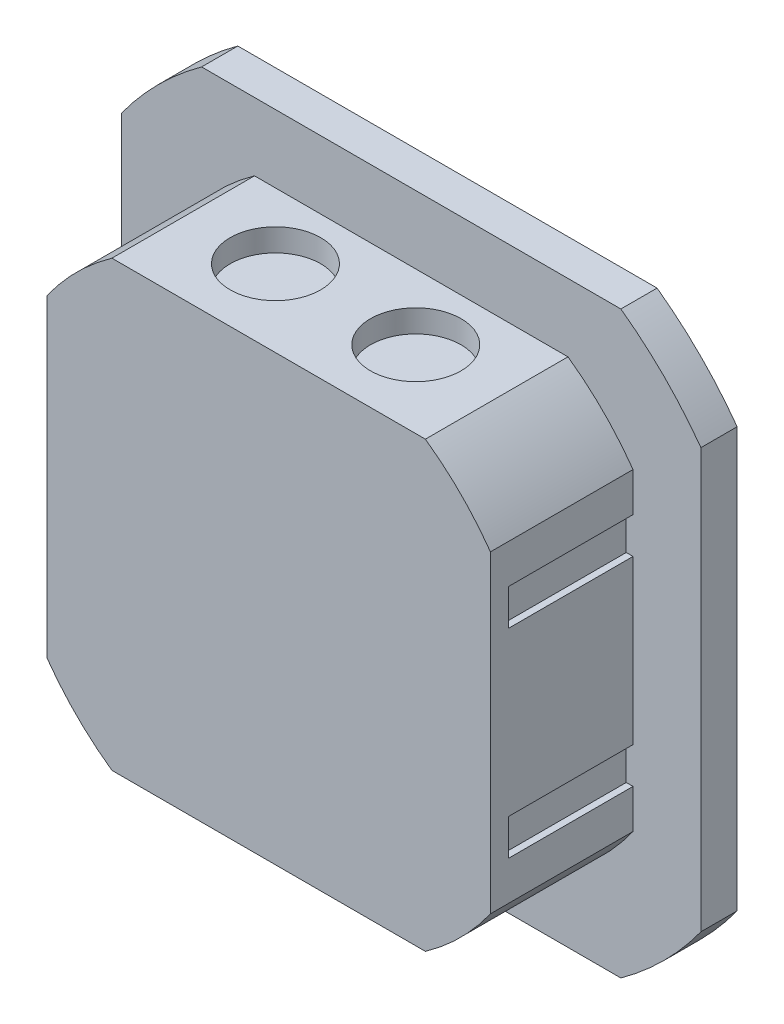
ISO-10303-21;
HEADER;
FILE_DESCRIPTION(('STEP AP214'),'2;1');
FILE_NAME('part.step','',(''),(''),'','','');
FILE_SCHEMA(('AUTOMOTIVE_DESIGN { 1 0 10303 214 1 1 1 1 }'));
ENDSEC;
DATA;
#1=APPLICATION_CONTEXT('core data for automotive mechanical design processes');
#2=APPLICATION_PROTOCOL_DEFINITION('international standard','automotive_design',2000,#1);
#3=PRODUCT_CONTEXT('',#1,'mechanical');
#4=PRODUCT('Part','Part','',(#3));
#5=PRODUCT_RELATED_PRODUCT_CATEGORY('part','',(#4));
#6=PRODUCT_DEFINITION_FORMATION('','',#4);
#7=PRODUCT_DEFINITION_CONTEXT('part definition',#1,'design');
#8=PRODUCT_DEFINITION('design','',#6,#7);
#9=PRODUCT_DEFINITION_SHAPE('','',#8);
#10=(LENGTH_UNIT() NAMED_UNIT(*) SI_UNIT(.MILLI.,.METRE.));
#11=(NAMED_UNIT(*) PLANE_ANGLE_UNIT() SI_UNIT($,.RADIAN.));
#12=(NAMED_UNIT(*) SI_UNIT($,.STERADIAN.) SOLID_ANGLE_UNIT());
#13=UNCERTAINTY_MEASURE_WITH_UNIT(LENGTH_MEASURE(1.E-05),#10,'distance_accuracy_value','');
#14=(GEOMETRIC_REPRESENTATION_CONTEXT(3) GLOBAL_UNCERTAINTY_ASSIGNED_CONTEXT((#13)) GLOBAL_UNIT_ASSIGNED_CONTEXT((#10,
#11,#12)) REPRESENTATION_CONTEXT('',''));
#15=CARTESIAN_POINT('',(0.,0.,0.));
#16=DIRECTION('',(0.,0.,1.));
#17=DIRECTION('',(1.,0.,0.));
#18=AXIS2_PLACEMENT_3D('',#15,#16,#17);
#19=CARTESIAN_POINT('',(-15.5,44.,14.5));
#20=DIRECTION('',(0.,1.,0.));
#21=DIRECTION('',(0.,0.,1.));
#22=AXIS2_PLACEMENT_3D('',#19,#20,#21);
#23=PLANE('',#22);
#24=CARTESIAN_POINT('',(-15.5,44.,14.5));
#25=DIRECTION('',(0.,-1.,0.));
#26=DIRECTION('',(0.,0.,-1.));
#27=AXIS2_PLACEMENT_3D('',#24,#25,#26);
#28=CIRCLE('',#27,10.);
#29=CARTESIAN_POINT('',(-15.5,44.,4.5));
#30=VERTEX_POINT('',#29);
#31=EDGE_CURVE('E20',#30,#30,#28,.F.);
#32=ORIENTED_EDGE('',*,*,#31,.T.);
#33=EDGE_LOOP('',(#32));
#34=FACE_BOUND('',#33,.T.);
#35=ADVANCED_FACE('F17',(#34),#23,.T.);
#36=CARTESIAN_POINT('',(15.5,44.,14.5));
#37=DIRECTION('',(0.,1.,0.));
#38=DIRECTION('',(0.,0.,1.));
#39=AXIS2_PLACEMENT_3D('',#36,#37,#38);
#40=PLANE('',#39);
#41=CARTESIAN_POINT('',(15.5,44.,14.5));
#42=DIRECTION('',(0.,-1.,0.));
#43=DIRECTION('',(0.,0.,-1.));
#44=AXIS2_PLACEMENT_3D('',#41,#42,#43);
#45=CIRCLE('',#44,10.);
#46=CARTESIAN_POINT('',(15.5,44.,4.5));
#47=VERTEX_POINT('',#46);
#48=EDGE_CURVE('E290',#47,#47,#45,.F.);
#49=ORIENTED_EDGE('',*,*,#48,.T.);
#50=EDGE_LOOP('',(#49));
#51=FACE_BOUND('',#50,.T.);
#52=ADVANCED_FACE('F751',(#51),#40,.T.);
#53=CARTESIAN_POINT('',(-49.,26.,0.));
#54=DIRECTION('',(0.,1.,0.));
#55=DIRECTION('',(0.,0.,1.));
#56=AXIS2_PLACEMENT_3D('',#53,#54,#55);
#57=PLANE('',#56);
#58=DIRECTION('',(0.,0.,1.));
#59=VECTOR('',#58,1.);
#60=CARTESIAN_POINT('',(-49.,26.,31.5));
#61=LINE('',#60,#59);
#62=CARTESIAN_POINT('',(-49.,26.,0.));
#63=VERTEX_POINT('',#62);
#64=CARTESIAN_POINT('',(-49.,26.,27.5));
#65=VERTEX_POINT('',#64);
#66=EDGE_CURVE('E356',#63,#65,#61,.T.);
#67=ORIENTED_EDGE('',*,*,#66,.F.);
#68=DIRECTION('',(1.,0.,0.));
#69=VECTOR('',#68,1.);
#70=CARTESIAN_POINT('',(-49.,26.,0.));
#71=LINE('',#70,#69);
#72=CARTESIAN_POINT('',(-47.5,26.,0.));
#73=VERTEX_POINT('',#72);
#74=EDGE_CURVE('E182',#73,#63,#71,.F.);
#75=ORIENTED_EDGE('',*,*,#74,.F.);
#76=DIRECTION('',(0.,0.,-1.));
#77=VECTOR('',#76,1.);
#78=CARTESIAN_POINT('',(-47.5,26.,0.));
#79=LINE('',#78,#77);
#80=CARTESIAN_POINT('',(-47.5,26.,27.5));
#81=VERTEX_POINT('',#80);
#82=EDGE_CURVE('E412',#73,#81,#79,.F.);
#83=ORIENTED_EDGE('',*,*,#82,.T.);
#84=DIRECTION('',(1.,0.,0.));
#85=VECTOR('',#84,1.);
#86=CARTESIAN_POINT('',(-48.25,26.,27.5));
#87=LINE('',#86,#85);
#88=EDGE_CURVE('E346',#81,#65,#87,.F.);
#89=ORIENTED_EDGE('',*,*,#88,.T.);
#90=EDGE_LOOP('',(#67,#75,#83,#89));
#91=FACE_BOUND('',#90,.T.);
#92=ADVANCED_FACE('F723',(#91),#57,.F.);
#93=CARTESIAN_POINT('',(-48.25,22.,27.5));
#94=DIRECTION('',(0.,0.,1.));
#95=DIRECTION('',(1.,0.,0.));
#96=AXIS2_PLACEMENT_3D('',#93,#94,#95);
#97=PLANE('',#96);
#98=DIRECTION('',(1.,0.,0.));
#99=VECTOR('',#98,1.);
#100=CARTESIAN_POINT('',(-47.5,18.,27.5));
#101=LINE('',#100,#99);
#102=CARTESIAN_POINT('',(-47.5,18.,27.5));
#103=VERTEX_POINT('',#102);
#104=CARTESIAN_POINT('',(-49.,18.,27.5));
#105=VERTEX_POINT('',#104);
#106=EDGE_CURVE('E334',#103,#105,#101,.F.);
#107=ORIENTED_EDGE('',*,*,#106,.T.);
#108=DIRECTION('',(0.,1.,0.));
#109=VECTOR('',#108,1.);
#110=CARTESIAN_POINT('',(-49.,49.,27.5));
#111=LINE('',#110,#109);
#112=EDGE_CURVE('E354',#65,#105,#111,.F.);
#113=ORIENTED_EDGE('',*,*,#112,.F.);
#114=ORIENTED_EDGE('',*,*,#88,.F.);
#115=DIRECTION('',(0.,1.,0.));
#116=VECTOR('',#115,1.);
#117=CARTESIAN_POINT('',(-47.5,26.,27.5));
#118=LINE('',#117,#116);
#119=EDGE_CURVE('E409',#81,#103,#118,.F.);
#120=ORIENTED_EDGE('',*,*,#119,.T.);
#121=EDGE_LOOP('',(#107,#113,#114,#120));
#122=FACE_BOUND('',#121,.T.);
#123=ADVANCED_FACE('F726',(#122),#97,.F.);
#124=CARTESIAN_POINT('',(-47.5,18.,0.));
#125=DIRECTION('',(0.,-1.,0.));
#126=DIRECTION('',(0.,0.,-1.));
#127=AXIS2_PLACEMENT_3D('',#124,#125,#126);
#128=PLANE('',#127);
#129=DIRECTION('',(0.,0.,-1.));
#130=VECTOR('',#129,1.);
#131=CARTESIAN_POINT('',(-47.5,18.,0.));
#132=LINE('',#131,#130);
#133=CARTESIAN_POINT('',(-47.5,18.,0.));
#134=VERTEX_POINT('',#133);
#135=EDGE_CURVE('E397',#103,#134,#132,.T.);
#136=ORIENTED_EDGE('',*,*,#135,.T.);
#137=DIRECTION('',(1.,0.,0.));
#138=VECTOR('',#137,1.);
#139=CARTESIAN_POINT('',(-47.5,18.,0.));
#140=LINE('',#139,#138);
#141=CARTESIAN_POINT('',(-49.,18.,0.));
#142=VERTEX_POINT('',#141);
#143=EDGE_CURVE('E190',#142,#134,#140,.T.);
#144=ORIENTED_EDGE('',*,*,#143,.F.);
#145=DIRECTION('',(0.,0.,1.));
#146=VECTOR('',#145,1.);
#147=CARTESIAN_POINT('',(-49.,18.,31.5));
#148=LINE('',#147,#146);
#149=EDGE_CURVE('E330',#105,#142,#148,.F.);
#150=ORIENTED_EDGE('',*,*,#149,.F.);
#151=ORIENTED_EDGE('',*,*,#106,.F.);
#152=EDGE_LOOP('',(#136,#144,#150,#151));
#153=FACE_BOUND('',#152,.T.);
#154=ADVANCED_FACE('F730',(#153),#128,.F.);
#155=CARTESIAN_POINT('',(-49.,-18.,0.));
#156=DIRECTION('',(0.,1.,0.));
#157=DIRECTION('',(0.,0.,1.));
#158=AXIS2_PLACEMENT_3D('',#155,#156,#157);
#159=PLANE('',#158);
#160=DIRECTION('',(0.,0.,1.));
#161=VECTOR('',#160,1.);
#162=CARTESIAN_POINT('',(-49.,-18.,31.5));
#163=LINE('',#162,#161);
#164=CARTESIAN_POINT('',(-49.,-18.,0.));
#165=VERTEX_POINT('',#164);
#166=CARTESIAN_POINT('',(-49.,-18.,27.5));
#167=VERTEX_POINT('',#166);
#168=EDGE_CURVE('E321',#165,#167,#163,.T.);
#169=ORIENTED_EDGE('',*,*,#168,.F.);
#170=DIRECTION('',(1.,0.,0.));
#171=VECTOR('',#170,1.);
#172=CARTESIAN_POINT('',(-49.,-18.,0.));
#173=LINE('',#172,#171);
#174=CARTESIAN_POINT('',(-47.5,-18.,0.));
#175=VERTEX_POINT('',#174);
#176=EDGE_CURVE('E326',#175,#165,#173,.F.);
#177=ORIENTED_EDGE('',*,*,#176,.F.);
#178=DIRECTION('',(0.,0.,-1.));
#179=VECTOR('',#178,1.);
#180=CARTESIAN_POINT('',(-47.5,-18.,0.));
#181=LINE('',#180,#179);
#182=CARTESIAN_POINT('',(-47.5,-18.,27.5));
#183=VERTEX_POINT('',#182);
#184=EDGE_CURVE('E390',#175,#183,#181,.F.);
#185=ORIENTED_EDGE('',*,*,#184,.T.);
#186=DIRECTION('',(1.,0.,0.));
#187=VECTOR('',#186,1.);
#188=CARTESIAN_POINT('',(-48.25,-18.,27.5));
#189=LINE('',#188,#187);
#190=EDGE_CURVE('E311',#183,#167,#189,.F.);
#191=ORIENTED_EDGE('',*,*,#190,.T.);
#192=EDGE_LOOP('',(#169,#177,#185,#191));
#193=FACE_BOUND('',#192,.T.);
#194=ADVANCED_FACE('F736',(#193),#159,.F.);
#195=CARTESIAN_POINT('',(-48.25,-22.,27.5));
#196=DIRECTION('',(0.,0.,1.));
#197=DIRECTION('',(1.,0.,0.));
#198=AXIS2_PLACEMENT_3D('',#195,#196,#197);
#199=PLANE('',#198);
#200=ORIENTED_EDGE('',*,*,#190,.F.);
#201=DIRECTION('',(0.,1.,0.));
#202=VECTOR('',#201,1.);
#203=CARTESIAN_POINT('',(-47.5,-18.,27.5));
#204=LINE('',#203,#202);
#205=CARTESIAN_POINT('',(-47.5,-26.,27.5));
#206=VERTEX_POINT('',#205);
#207=EDGE_CURVE('E394',#183,#206,#204,.F.);
#208=ORIENTED_EDGE('',*,*,#207,.T.);
#209=DIRECTION('',(1.,0.,0.));
#210=VECTOR('',#209,1.);
#211=CARTESIAN_POINT('',(-47.5,-26.,27.5));
#212=LINE('',#211,#210);
#213=CARTESIAN_POINT('',(-49.,-26.,27.5));
#214=VERTEX_POINT('',#213);
#215=EDGE_CURVE('E144',#206,#214,#212,.F.);
#216=ORIENTED_EDGE('',*,*,#215,.T.);
#217=DIRECTION('',(0.,1.,0.));
#218=VECTOR('',#217,1.);
#219=CARTESIAN_POINT('',(-49.,49.,27.5));
#220=LINE('',#219,#218);
#221=EDGE_CURVE('E317',#167,#214,#220,.F.);
#222=ORIENTED_EDGE('',*,*,#221,.F.);
#223=EDGE_LOOP('',(#200,#208,#216,#222));
#224=FACE_BOUND('',#223,.T.);
#225=ADVANCED_FACE('F498',(#224),#199,.F.);
#226=CARTESIAN_POINT('',(-47.5,-26.,0.));
#227=DIRECTION('',(0.,-1.,0.));
#228=DIRECTION('',(0.,0.,-1.));
#229=AXIS2_PLACEMENT_3D('',#226,#227,#228);
#230=PLANE('',#229);
#231=DIRECTION('',(0.,0.,-1.));
#232=VECTOR('',#231,1.);
#233=CARTESIAN_POINT('',(-47.5,-26.,0.));
#234=LINE('',#233,#232);
#235=CARTESIAN_POINT('',(-47.5,-26.,0.));
#236=VERTEX_POINT('',#235);
#237=EDGE_CURVE('E388',#206,#236,#234,.T.);
#238=ORIENTED_EDGE('',*,*,#237,.T.);
#239=DIRECTION('',(1.,0.,0.));
#240=VECTOR('',#239,1.);
#241=CARTESIAN_POINT('',(-47.5,-26.,0.));
#242=LINE('',#241,#240);
#243=CARTESIAN_POINT('',(-49.,-26.,0.));
#244=VERTEX_POINT('',#243);
#245=EDGE_CURVE('E309',#244,#236,#242,.T.);
#246=ORIENTED_EDGE('',*,*,#245,.F.);
#247=DIRECTION('',(0.,0.,1.));
#248=VECTOR('',#247,1.);
#249=CARTESIAN_POINT('',(-49.,-26.,31.5));
#250=LINE('',#249,#248);
#251=EDGE_CURVE('E320',#214,#244,#250,.F.);
#252=ORIENTED_EDGE('',*,*,#251,.F.);
#253=ORIENTED_EDGE('',*,*,#215,.F.);
#254=EDGE_LOOP('',(#238,#246,#252,#253));
#255=FACE_BOUND('',#254,.T.);
#256=ADVANCED_FACE('F487',(#255),#230,.F.);
#257=CARTESIAN_POINT('',(-15.5,49.,14.5));
#258=DIRECTION('',(0.,-1.,0.));
#259=DIRECTION('',(0.,0.,-1.));
#260=AXIS2_PLACEMENT_3D('',#257,#258,#259);
#261=CYLINDRICAL_SURFACE('',#260,10.);
#262=CARTESIAN_POINT('',(-15.5,49.,14.5));
#263=DIRECTION('',(0.,-1.,0.));
#264=DIRECTION('',(0.,0.,-1.));
#265=AXIS2_PLACEMENT_3D('',#262,#263,#264);
#266=CIRCLE('',#265,10.);
#267=CARTESIAN_POINT('',(-15.5,49.,4.5));
#268=VERTEX_POINT('',#267);
#269=EDGE_CURVE('E303',#268,#268,#266,.T.);
#270=ORIENTED_EDGE('',*,*,#269,.F.);
#271=EDGE_LOOP('',(#270));
#272=FACE_BOUND('',#271,.T.);
#273=ORIENTED_EDGE('',*,*,#31,.F.);
#274=EDGE_LOOP('',(#273));
#275=FACE_BOUND('',#274,.T.);
#276=ADVANCED_FACE('F484',(#272,#275),#261,.F.);
#277=CARTESIAN_POINT('',(15.5,49.,14.5));
#278=DIRECTION('',(0.,-1.,0.));
#279=DIRECTION('',(0.,0.,-1.));
#280=AXIS2_PLACEMENT_3D('',#277,#278,#279);
#281=CYLINDRICAL_SURFACE('',#280,10.);
#282=CARTESIAN_POINT('',(15.5,49.,14.5));
#283=DIRECTION('',(0.,-1.,0.));
#284=DIRECTION('',(0.,0.,-1.));
#285=AXIS2_PLACEMENT_3D('',#282,#283,#284);
#286=CIRCLE('',#285,10.);
#287=CARTESIAN_POINT('',(15.5,49.,4.5));
#288=VERTEX_POINT('',#287);
#289=EDGE_CURVE('E468',#288,#288,#286,.T.);
#290=ORIENTED_EDGE('',*,*,#289,.F.);
#291=EDGE_LOOP('',(#290));
#292=FACE_BOUND('',#291,.T.);
#293=ORIENTED_EDGE('',*,*,#48,.F.);
#294=EDGE_LOOP('',(#293));
#295=FACE_BOUND('',#294,.T.);
#296=ADVANCED_FACE('F486',(#292,#295),#281,.F.);
#297=CARTESIAN_POINT('',(49.,-26.,0.));
#298=DIRECTION('',(0.,-1.,0.));
#299=DIRECTION('',(0.,0.,-1.));
#300=AXIS2_PLACEMENT_3D('',#297,#298,#299);
#301=PLANE('',#300);
#302=DIRECTION('',(0.,0.,-1.));
#303=VECTOR('',#302,1.);
#304=CARTESIAN_POINT('',(49.,-26.,31.5));
#305=LINE('',#304,#303);
#306=CARTESIAN_POINT('',(49.,-26.,0.));
#307=VERTEX_POINT('',#306);
#308=CARTESIAN_POINT('',(49.,-26.,27.5));
#309=VERTEX_POINT('',#308);
#310=EDGE_CURVE('E298',#307,#309,#305,.F.);
#311=ORIENTED_EDGE('',*,*,#310,.F.);
#312=DIRECTION('',(1.,0.,0.));
#313=VECTOR('',#312,1.);
#314=CARTESIAN_POINT('',(49.,-26.,0.));
#315=LINE('',#314,#313);
#316=CARTESIAN_POINT('',(47.5,-26.,0.));
#317=VERTEX_POINT('',#316);
#318=EDGE_CURVE('E241',#317,#307,#315,.T.);
#319=ORIENTED_EDGE('',*,*,#318,.F.);
#320=DIRECTION('',(0.,0.,1.));
#321=VECTOR('',#320,1.);
#322=CARTESIAN_POINT('',(47.5,-26.,0.));
#323=LINE('',#322,#321);
#324=CARTESIAN_POINT('',(47.5,-26.,27.5));
#325=VERTEX_POINT('',#324);
#326=EDGE_CURVE('E380',#317,#325,#323,.T.);
#327=ORIENTED_EDGE('',*,*,#326,.T.);
#328=DIRECTION('',(1.,0.,0.));
#329=VECTOR('',#328,1.);
#330=CARTESIAN_POINT('',(48.25,-26.,27.5));
#331=LINE('',#330,#329);
#332=EDGE_CURVE('E258',#325,#309,#331,.T.);
#333=ORIENTED_EDGE('',*,*,#332,.T.);
#334=EDGE_LOOP('',(#311,#319,#327,#333));
#335=FACE_BOUND('',#334,.T.);
#336=ADVANCED_FACE('F495',(#335),#301,.F.);
#337=CARTESIAN_POINT('',(48.25,-22.,27.5));
#338=DIRECTION('',(0.,0.,1.));
#339=DIRECTION('',(1.,0.,0.));
#340=AXIS2_PLACEMENT_3D('',#337,#338,#339);
#341=PLANE('',#340);
#342=DIRECTION('',(0.,1.,0.));
#343=VECTOR('',#342,1.);
#344=CARTESIAN_POINT('',(49.,-49.,27.5));
#345=LINE('',#344,#343);
#346=CARTESIAN_POINT('',(49.,-18.,27.5));
#347=VERTEX_POINT('',#346);
#348=EDGE_CURVE('E266',#309,#347,#345,.T.);
#349=ORIENTED_EDGE('',*,*,#348,.F.);
#350=ORIENTED_EDGE('',*,*,#332,.F.);
#351=DIRECTION('',(0.,1.,0.));
#352=VECTOR('',#351,1.);
#353=CARTESIAN_POINT('',(47.5,-26.,27.5));
#354=LINE('',#353,#352);
#355=CARTESIAN_POINT('',(47.5,-18.,27.5));
#356=VERTEX_POINT('',#355);
#357=EDGE_CURVE('E377',#325,#356,#354,.T.);
#358=ORIENTED_EDGE('',*,*,#357,.T.);
#359=DIRECTION('',(1.,0.,0.));
#360=VECTOR('',#359,1.);
#361=CARTESIAN_POINT('',(47.5,-18.,27.5));
#362=LINE('',#361,#360);
#363=EDGE_CURVE('E257',#356,#347,#362,.T.);
#364=ORIENTED_EDGE('',*,*,#363,.T.);
#365=EDGE_LOOP('',(#349,#350,#358,#364));
#366=FACE_BOUND('',#365,.T.);
#367=ADVANCED_FACE('F605',(#366),#341,.F.);
#368=CARTESIAN_POINT('',(47.5,-18.,0.));
#369=DIRECTION('',(0.,1.,0.));
#370=DIRECTION('',(0.,0.,1.));
#371=AXIS2_PLACEMENT_3D('',#368,#369,#370);
#372=PLANE('',#371);
#373=DIRECTION('',(0.,0.,1.));
#374=VECTOR('',#373,1.);
#375=CARTESIAN_POINT('',(47.5,-18.,0.));
#376=LINE('',#375,#374);
#377=CARTESIAN_POINT('',(47.5,-18.,0.));
#378=VERTEX_POINT('',#377);
#379=EDGE_CURVE('E255',#356,#378,#376,.F.);
#380=ORIENTED_EDGE('',*,*,#379,.T.);
#381=DIRECTION('',(1.,0.,0.));
#382=VECTOR('',#381,1.);
#383=CARTESIAN_POINT('',(47.5,-18.,0.));
#384=LINE('',#383,#382);
#385=CARTESIAN_POINT('',(49.,-18.,0.));
#386=VERTEX_POINT('',#385);
#387=EDGE_CURVE('E247',#386,#378,#384,.F.);
#388=ORIENTED_EDGE('',*,*,#387,.F.);
#389=DIRECTION('',(0.,0.,-1.));
#390=VECTOR('',#389,1.);
#391=CARTESIAN_POINT('',(49.,-18.,31.5));
#392=LINE('',#391,#390);
#393=EDGE_CURVE('E253',#347,#386,#392,.T.);
#394=ORIENTED_EDGE('',*,*,#393,.F.);
#395=ORIENTED_EDGE('',*,*,#363,.F.);
#396=EDGE_LOOP('',(#380,#388,#394,#395));
#397=FACE_BOUND('',#396,.T.);
#398=ADVANCED_FACE('F252',(#397),#372,.F.);
#399=CARTESIAN_POINT('',(49.,18.,0.));
#400=DIRECTION('',(0.,-1.,0.));
#401=DIRECTION('',(0.,0.,-1.));
#402=AXIS2_PLACEMENT_3D('',#399,#400,#401);
#403=PLANE('',#402);
#404=DIRECTION('',(0.,0.,-1.));
#405=VECTOR('',#404,1.);
#406=CARTESIAN_POINT('',(49.,18.,31.5));
#407=LINE('',#406,#405);
#408=CARTESIAN_POINT('',(49.,18.,0.));
#409=VERTEX_POINT('',#408);
#410=CARTESIAN_POINT('',(49.,18.,27.5));
#411=VERTEX_POINT('',#410);
#412=EDGE_CURVE('E268',#409,#411,#407,.F.);
#413=ORIENTED_EDGE('',*,*,#412,.F.);
#414=DIRECTION('',(1.,0.,0.));
#415=VECTOR('',#414,1.);
#416=CARTESIAN_POINT('',(49.,18.,0.));
#417=LINE('',#416,#415);
#418=CARTESIAN_POINT('',(47.5,18.,0.));
#419=VERTEX_POINT('',#418);
#420=EDGE_CURVE('E273',#419,#409,#417,.T.);
#421=ORIENTED_EDGE('',*,*,#420,.F.);
#422=DIRECTION('',(0.,0.,1.));
#423=VECTOR('',#422,1.);
#424=CARTESIAN_POINT('',(47.5,18.,0.));
#425=LINE('',#424,#423);
#426=CARTESIAN_POINT('',(47.5,18.,27.5));
#427=VERTEX_POINT('',#426);
#428=EDGE_CURVE('E362',#419,#427,#425,.T.);
#429=ORIENTED_EDGE('',*,*,#428,.T.);
#430=DIRECTION('',(1.,0.,0.));
#431=VECTOR('',#430,1.);
#432=CARTESIAN_POINT('',(48.25,18.,27.5));
#433=LINE('',#432,#431);
#434=EDGE_CURVE('E680',#427,#411,#433,.T.);
#435=ORIENTED_EDGE('',*,*,#434,.T.);
#436=EDGE_LOOP('',(#413,#421,#429,#435));
#437=FACE_BOUND('',#436,.T.);
#438=ADVANCED_FACE('F598',(#437),#403,.F.);
#439=CARTESIAN_POINT('',(48.25,22.,27.5));
#440=DIRECTION('',(0.,0.,1.));
#441=DIRECTION('',(1.,0.,0.));
#442=AXIS2_PLACEMENT_3D('',#439,#440,#441);
#443=PLANE('',#442);
#444=ORIENTED_EDGE('',*,*,#434,.F.);
#445=DIRECTION('',(0.,1.,0.));
#446=VECTOR('',#445,1.);
#447=CARTESIAN_POINT('',(47.5,18.,27.5));
#448=LINE('',#447,#446);
#449=CARTESIAN_POINT('',(47.5,26.,27.5));
#450=VERTEX_POINT('',#449);
#451=EDGE_CURVE('E366',#427,#450,#448,.T.);
#452=ORIENTED_EDGE('',*,*,#451,.T.);
#453=DIRECTION('',(1.,0.,0.));
#454=VECTOR('',#453,1.);
#455=CARTESIAN_POINT('',(47.5,26.,27.5));
#456=LINE('',#455,#454);
#457=CARTESIAN_POINT('',(49.,26.,27.5));
#458=VERTEX_POINT('',#457);
#459=EDGE_CURVE('E676',#450,#458,#456,.T.);
#460=ORIENTED_EDGE('',*,*,#459,.T.);
#461=DIRECTION('',(0.,1.,0.));
#462=VECTOR('',#461,1.);
#463=CARTESIAN_POINT('',(49.,-49.,27.5));
#464=LINE('',#463,#462);
#465=EDGE_CURVE('E653',#411,#458,#464,.T.);
#466=ORIENTED_EDGE('',*,*,#465,.F.);
#467=EDGE_LOOP('',(#444,#452,#460,#466));
#468=FACE_BOUND('',#467,.T.);
#469=ADVANCED_FACE('F594',(#468),#443,.F.);
#470=CARTESIAN_POINT('',(47.5,26.,0.));
#471=DIRECTION('',(0.,1.,0.));
#472=DIRECTION('',(0.,0.,1.));
#473=AXIS2_PLACEMENT_3D('',#470,#471,#472);
#474=PLANE('',#473);
#475=DIRECTION('',(0.,0.,1.));
#476=VECTOR('',#475,1.);
#477=CARTESIAN_POINT('',(47.5,26.,0.));
#478=LINE('',#477,#476);
#479=CARTESIAN_POINT('',(47.5,26.,0.));
#480=VERTEX_POINT('',#479);
#481=EDGE_CURVE('E359',#450,#480,#478,.F.);
#482=ORIENTED_EDGE('',*,*,#481,.T.);
#483=DIRECTION('',(1.,0.,0.));
#484=VECTOR('',#483,1.);
#485=CARTESIAN_POINT('',(47.5,26.,0.));
#486=LINE('',#485,#484);
#487=CARTESIAN_POINT('',(49.,26.,0.));
#488=VERTEX_POINT('',#487);
#489=EDGE_CURVE('E678',#488,#480,#486,.F.);
#490=ORIENTED_EDGE('',*,*,#489,.F.);
#491=DIRECTION('',(0.,0.,-1.));
#492=VECTOR('',#491,1.);
#493=CARTESIAN_POINT('',(49.,26.,31.5));
#494=LINE('',#493,#492);
#495=EDGE_CURVE('E650',#458,#488,#494,.T.);
#496=ORIENTED_EDGE('',*,*,#495,.F.);
#497=ORIENTED_EDGE('',*,*,#459,.F.);
#498=EDGE_LOOP('',(#482,#490,#496,#497));
#499=FACE_BOUND('',#498,.T.);
#500=ADVANCED_FACE('F590',(#499),#474,.F.);
#501=CARTESIAN_POINT('',(0.,0.,31.5));
#502=DIRECTION('',(0.,0.,-1.));
#503=DIRECTION('',(-1.,0.,0.));
#504=AXIS2_PLACEMENT_3D('',#501,#502,#503);
#505=PLANE('',#504);
#506=CARTESIAN_POINT('',(0.,0.,31.5));
#507=DIRECTION('',(0.,0.,1.));
#508=DIRECTION('',(1.,0.,0.));
#509=AXIS2_PLACEMENT_3D('',#506,#507,#508);
#510=CIRCLE('',#509,60.);
#511=CARTESIAN_POINT('',(-34.6265793863616,-49.,31.5));
#512=VERTEX_POINT('',#511);
#513=CARTESIAN_POINT('',(-49.,-34.6265793863616,31.5));
#514=VERTEX_POINT('',#513);
#515=EDGE_CURVE('E391',#512,#514,#510,.F.);
#516=ORIENTED_EDGE('',*,*,#515,.F.);
#517=DIRECTION('',(1.,0.,0.));
#518=VECTOR('',#517,1.);
#519=CARTESIAN_POINT('',(-49.,-49.,31.5));
#520=LINE('',#519,#518);
#521=CARTESIAN_POINT('',(34.6265793863616,-49.,31.5));
#522=VERTEX_POINT('',#521);
#523=EDGE_CURVE('E135',#522,#512,#520,.F.);
#524=ORIENTED_EDGE('',*,*,#523,.F.);
#525=CARTESIAN_POINT('',(0.,0.,31.5));
#526=DIRECTION('',(0.,0.,1.));
#527=DIRECTION('',(1.,0.,0.));
#528=AXIS2_PLACEMENT_3D('',#525,#526,#527);
#529=CIRCLE('',#528,60.);
#530=CARTESIAN_POINT('',(49.,-34.6265793863616,31.5));
#531=VERTEX_POINT('',#530);
#532=EDGE_CURVE('E462',#531,#522,#529,.F.);
#533=ORIENTED_EDGE('',*,*,#532,.F.);
#534=DIRECTION('',(0.,1.,0.));
#535=VECTOR('',#534,1.);
#536=CARTESIAN_POINT('',(49.,-49.,31.5));
#537=LINE('',#536,#535);
#538=CARTESIAN_POINT('',(49.,34.6265793863616,31.5));
#539=VERTEX_POINT('',#538);
#540=EDGE_CURVE('E642',#539,#531,#537,.F.);
#541=ORIENTED_EDGE('',*,*,#540,.F.);
#542=CARTESIAN_POINT('',(0.,0.,31.5));
#543=DIRECTION('',(0.,0.,1.));
#544=DIRECTION('',(1.,0.,0.));
#545=AXIS2_PLACEMENT_3D('',#542,#543,#544);
#546=CIRCLE('',#545,60.);
#547=CARTESIAN_POINT('',(34.6265793863616,49.,31.5));
#548=VERTEX_POINT('',#547);
#549=EDGE_CURVE('E363',#548,#539,#546,.F.);
#550=ORIENTED_EDGE('',*,*,#549,.F.);
#551=DIRECTION('',(1.,0.,0.));
#552=VECTOR('',#551,1.);
#553=CARTESIAN_POINT('',(49.,49.,31.5));
#554=LINE('',#553,#552);
#555=CARTESIAN_POINT('',(-34.6265793863616,49.,31.5));
#556=VERTEX_POINT('',#555);
#557=EDGE_CURVE('E301',#556,#548,#554,.T.);
#558=ORIENTED_EDGE('',*,*,#557,.F.);
#559=CARTESIAN_POINT('',(0.,0.,31.5));
#560=DIRECTION('',(0.,0.,1.));
#561=DIRECTION('',(1.,0.,0.));
#562=AXIS2_PLACEMENT_3D('',#559,#560,#561);
#563=CIRCLE('',#562,60.);
#564=CARTESIAN_POINT('',(-49.,34.6265793863615,31.5));
#565=VERTEX_POINT('',#564);
#566=EDGE_CURVE('E473',#565,#556,#563,.F.);
#567=ORIENTED_EDGE('',*,*,#566,.F.);
#568=DIRECTION('',(0.,1.,0.));
#569=VECTOR('',#568,1.);
#570=CARTESIAN_POINT('',(-49.,49.,31.5));
#571=LINE('',#570,#569);
#572=EDGE_CURVE('E305',#514,#565,#571,.T.);
#573=ORIENTED_EDGE('',*,*,#572,.F.);
#574=EDGE_LOOP('',(#516,#524,#533,#541,#550,#558,#567,#573));
#575=FACE_BOUND('',#574,.T.);
#576=ADVANCED_FACE('F587',(#575),#505,.F.);
#577=CARTESIAN_POINT('',(-49.,-49.,31.5));
#578=DIRECTION('',(0.,-1.,0.));
#579=DIRECTION('',(0.,0.,-1.));
#580=AXIS2_PLACEMENT_3D('',#577,#578,#579);
#581=PLANE('',#580);
#582=DIRECTION('',(0.,0.,1.));
#583=VECTOR('',#582,1.);
#584=CARTESIAN_POINT('',(-34.6265793863616,-49.,0.));
#585=LINE('',#584,#583);
#586=CARTESIAN_POINT('',(-34.6265793863616,-49.,0.));
#587=VERTEX_POINT('',#586);
#588=EDGE_CURVE('E476',#587,#512,#585,.T.);
#589=ORIENTED_EDGE('',*,*,#588,.F.);
#590=DIRECTION('',(1.,0.,0.));
#591=VECTOR('',#590,1.);
#592=CARTESIAN_POINT('',(0.,-49.,0.));
#593=LINE('',#592,#591);
#594=CARTESIAN_POINT('',(34.6265793863616,-49.,0.));
#595=VERTEX_POINT('',#594);
#596=EDGE_CURVE('E461',#595,#587,#593,.F.);
#597=ORIENTED_EDGE('',*,*,#596,.F.);
#598=DIRECTION('',(0.,0.,1.));
#599=VECTOR('',#598,1.);
#600=CARTESIAN_POINT('',(34.6265793863616,-49.,0.));
#601=LINE('',#600,#599);
#602=EDGE_CURVE('E464',#522,#595,#601,.F.);
#603=ORIENTED_EDGE('',*,*,#602,.F.);
#604=ORIENTED_EDGE('',*,*,#523,.T.);
#605=EDGE_LOOP('',(#589,#597,#603,#604));
#606=FACE_BOUND('',#605,.T.);
#607=ADVANCED_FACE('F583',(#606),#581,.T.);
#608=CARTESIAN_POINT('',(0.,0.,0.));
#609=DIRECTION('',(0.,0.,1.));
#610=DIRECTION('',(1.,0.,0.));
#611=AXIS2_PLACEMENT_3D('',#608,#609,#610);
#612=CYLINDRICAL_SURFACE('',#611,60.);
#613=ORIENTED_EDGE('',*,*,#588,.T.);
#614=ORIENTED_EDGE('',*,*,#515,.T.);
#615=DIRECTION('',(0.,0.,1.));
#616=VECTOR('',#615,1.);
#617=CARTESIAN_POINT('',(-49.,-34.6265793863616,31.5));
#618=LINE('',#617,#616);
#619=CARTESIAN_POINT('',(-49.,-34.6265793863616,0.));
#620=VERTEX_POINT('',#619);
#621=EDGE_CURVE('E308',#620,#514,#618,.T.);
#622=ORIENTED_EDGE('',*,*,#621,.F.);
#623=CARTESIAN_POINT('',(0.,0.,0.));
#624=DIRECTION('',(0.,0.,1.));
#625=DIRECTION('',(1.,0.,0.));
#626=AXIS2_PLACEMENT_3D('',#623,#624,#625);
#627=CIRCLE('',#626,60.);
#628=EDGE_CURVE('E459',#587,#620,#627,.F.);
#629=ORIENTED_EDGE('',*,*,#628,.F.);
#630=EDGE_LOOP('',(#613,#614,#622,#629));
#631=FACE_BOUND('',#630,.T.);
#632=ADVANCED_FACE('F579',(#631),#612,.T.);
#633=CARTESIAN_POINT('',(-47.5,-18.,0.));
#634=DIRECTION('',(1.,0.,0.));
#635=DIRECTION('',(0.,0.,-1.));
#636=AXIS2_PLACEMENT_3D('',#633,#634,#635);
#637=PLANE('',#636);
#638=ORIENTED_EDGE('',*,*,#184,.F.);
#639=DIRECTION('',(0.,1.,0.));
#640=VECTOR('',#639,1.);
#641=CARTESIAN_POINT('',(-47.5,0.,0.));
#642=LINE('',#641,#640);
#643=EDGE_CURVE('E340',#236,#175,#642,.T.);
#644=ORIENTED_EDGE('',*,*,#643,.F.);
#645=ORIENTED_EDGE('',*,*,#237,.F.);
#646=ORIENTED_EDGE('',*,*,#207,.F.);
#647=EDGE_LOOP('',(#638,#644,#645,#646));
#648=FACE_BOUND('',#647,.T.);
#649=ADVANCED_FACE('F575',(#648),#637,.F.);
#650=CARTESIAN_POINT('',(-47.5,26.,0.));
#651=DIRECTION('',(1.,0.,0.));
#652=DIRECTION('',(0.,0.,-1.));
#653=AXIS2_PLACEMENT_3D('',#650,#651,#652);
#654=PLANE('',#653);
#655=ORIENTED_EDGE('',*,*,#82,.F.);
#656=DIRECTION('',(0.,1.,0.));
#657=VECTOR('',#656,1.);
#658=CARTESIAN_POINT('',(-47.5,0.,0.));
#659=LINE('',#658,#657);
#660=EDGE_CURVE('E339',#134,#73,#659,.T.);
#661=ORIENTED_EDGE('',*,*,#660,.F.);
#662=ORIENTED_EDGE('',*,*,#135,.F.);
#663=ORIENTED_EDGE('',*,*,#119,.F.);
#664=EDGE_LOOP('',(#655,#661,#662,#663));
#665=FACE_BOUND('',#664,.T.);
#666=ADVANCED_FACE('F571',(#665),#654,.F.);
#667=CARTESIAN_POINT('',(-49.,49.,31.5));
#668=DIRECTION('',(-1.,0.,0.));
#669=DIRECTION('',(0.,0.,1.));
#670=AXIS2_PLACEMENT_3D('',#667,#668,#669);
#671=PLANE('',#670);
#672=DIRECTION('',(0.,0.,1.));
#673=VECTOR('',#672,1.);
#674=CARTESIAN_POINT('',(-49.,34.6265793863615,0.));
#675=LINE('',#674,#673);
#676=CARTESIAN_POINT('',(-49.,34.6265793863615,0.));
#677=VERTEX_POINT('',#676);
#678=EDGE_CURVE('E307',#677,#565,#675,.T.);
#679=ORIENTED_EDGE('',*,*,#678,.F.);
#680=DIRECTION('',(0.,1.,0.));
#681=VECTOR('',#680,1.);
#682=CARTESIAN_POINT('',(-49.,0.,0.));
#683=LINE('',#682,#681);
#684=EDGE_CURVE('E419',#63,#677,#683,.T.);
#685=ORIENTED_EDGE('',*,*,#684,.F.);
#686=ORIENTED_EDGE('',*,*,#66,.T.);
#687=ORIENTED_EDGE('',*,*,#112,.T.);
#688=ORIENTED_EDGE('',*,*,#149,.T.);
#689=DIRECTION('',(0.,1.,0.));
#690=VECTOR('',#689,1.);
#691=CARTESIAN_POINT('',(-49.,0.,0.));
#692=LINE('',#691,#690);
#693=EDGE_CURVE('E337',#165,#142,#692,.T.);
#694=ORIENTED_EDGE('',*,*,#693,.F.);
#695=ORIENTED_EDGE('',*,*,#168,.T.);
#696=ORIENTED_EDGE('',*,*,#221,.T.);
#697=ORIENTED_EDGE('',*,*,#251,.T.);
#698=DIRECTION('',(0.,1.,0.));
#699=VECTOR('',#698,1.);
#700=CARTESIAN_POINT('',(-49.,0.,0.));
#701=LINE('',#700,#699);
#702=EDGE_CURVE('E402',#620,#244,#701,.T.);
#703=ORIENTED_EDGE('',*,*,#702,.F.);
#704=ORIENTED_EDGE('',*,*,#621,.T.);
#705=ORIENTED_EDGE('',*,*,#572,.T.);
#706=EDGE_LOOP('',(#679,#685,#686,#687,#688,#694,#695,#696,#697,#703,#704,#705));
#707=FACE_BOUND('',#706,.T.);
#708=ADVANCED_FACE('F567',(#707),#671,.T.);
#709=CARTESIAN_POINT('',(0.,0.,0.));
#710=DIRECTION('',(0.,0.,1.));
#711=DIRECTION('',(1.,0.,0.));
#712=AXIS2_PLACEMENT_3D('',#709,#710,#711);
#713=CYLINDRICAL_SURFACE('',#712,60.);
#714=DIRECTION('',(0.,0.,1.));
#715=VECTOR('',#714,1.);
#716=CARTESIAN_POINT('',(-34.6265793863616,49.,31.5));
#717=LINE('',#716,#715);
#718=CARTESIAN_POINT('',(-34.6265793863616,49.,0.));
#719=VERTEX_POINT('',#718);
#720=EDGE_CURVE('E304',#719,#556,#717,.T.);
#721=ORIENTED_EDGE('',*,*,#720,.F.);
#722=CARTESIAN_POINT('',(0.,0.,0.));
#723=DIRECTION('',(0.,0.,1.));
#724=DIRECTION('',(1.,0.,0.));
#725=AXIS2_PLACEMENT_3D('',#722,#723,#724);
#726=CIRCLE('',#725,60.);
#727=EDGE_CURVE('E457',#677,#719,#726,.F.);
#728=ORIENTED_EDGE('',*,*,#727,.F.);
#729=ORIENTED_EDGE('',*,*,#678,.T.);
#730=ORIENTED_EDGE('',*,*,#566,.T.);
#731=EDGE_LOOP('',(#721,#728,#729,#730));
#732=FACE_BOUND('',#731,.T.);
#733=ADVANCED_FACE('F563',(#732),#713,.T.);
#734=CARTESIAN_POINT('',(49.,49.,31.5));
#735=DIRECTION('',(0.,1.,0.));
#736=DIRECTION('',(0.,0.,1.));
#737=AXIS2_PLACEMENT_3D('',#734,#735,#736);
#738=PLANE('',#737);
#739=ORIENTED_EDGE('',*,*,#289,.T.);
#740=EDGE_LOOP('',(#739));
#741=FACE_BOUND('',#740,.T.);
#742=ORIENTED_EDGE('',*,*,#269,.T.);
#743=EDGE_LOOP('',(#742));
#744=FACE_BOUND('',#743,.T.);
#745=DIRECTION('',(0.,0.,1.));
#746=VECTOR('',#745,1.);
#747=CARTESIAN_POINT('',(34.6265793863616,49.,0.));
#748=LINE('',#747,#746);
#749=CARTESIAN_POINT('',(34.6265793863616,49.,0.));
#750=VERTEX_POINT('',#749);
#751=EDGE_CURVE('E467',#750,#548,#748,.T.);
#752=ORIENTED_EDGE('',*,*,#751,.F.);
#753=DIRECTION('',(1.,0.,0.));
#754=VECTOR('',#753,1.);
#755=CARTESIAN_POINT('',(0.,49.,0.));
#756=LINE('',#755,#754);
#757=EDGE_CURVE('E456',#719,#750,#756,.T.);
#758=ORIENTED_EDGE('',*,*,#757,.F.);
#759=ORIENTED_EDGE('',*,*,#720,.T.);
#760=ORIENTED_EDGE('',*,*,#557,.T.);
#761=EDGE_LOOP('',(#752,#758,#759,#760));
#762=FACE_BOUND('',#761,.T.);
#763=ADVANCED_FACE('F559',(#741,#744,#762),#738,.T.);
#764=CARTESIAN_POINT('',(0.,0.,0.));
#765=DIRECTION('',(0.,0.,1.));
#766=DIRECTION('',(1.,0.,0.));
#767=AXIS2_PLACEMENT_3D('',#764,#765,#766);
#768=CYLINDRICAL_SURFACE('',#767,60.);
#769=DIRECTION('',(0.,0.,-1.));
#770=VECTOR('',#769,1.);
#771=CARTESIAN_POINT('',(49.,34.6265793863616,31.5));
#772=LINE('',#771,#770);
#773=CARTESIAN_POINT('',(49.,34.6265793863616,0.));
#774=VERTEX_POINT('',#773);
#775=EDGE_CURVE('E647',#774,#539,#772,.F.);
#776=ORIENTED_EDGE('',*,*,#775,.F.);
#777=CARTESIAN_POINT('',(0.,0.,0.));
#778=DIRECTION('',(0.,0.,1.));
#779=DIRECTION('',(1.,0.,0.));
#780=AXIS2_PLACEMENT_3D('',#777,#778,#779);
#781=CIRCLE('',#780,60.);
#782=EDGE_CURVE('E454',#750,#774,#781,.F.);
#783=ORIENTED_EDGE('',*,*,#782,.F.);
#784=ORIENTED_EDGE('',*,*,#751,.T.);
#785=ORIENTED_EDGE('',*,*,#549,.T.);
#786=EDGE_LOOP('',(#776,#783,#784,#785));
#787=FACE_BOUND('',#786,.T.);
#788=ADVANCED_FACE('F555',(#787),#768,.T.);
#789=CARTESIAN_POINT('',(47.5,18.,0.));
#790=DIRECTION('',(-1.,0.,0.));
#791=DIRECTION('',(0.,0.,1.));
#792=AXIS2_PLACEMENT_3D('',#789,#790,#791);
#793=PLANE('',#792);
#794=ORIENTED_EDGE('',*,*,#428,.F.);
#795=DIRECTION('',(0.,1.,0.));
#796=VECTOR('',#795,1.);
#797=CARTESIAN_POINT('',(47.5,0.,0.));
#798=LINE('',#797,#796);
#799=EDGE_CURVE('E276',#480,#419,#798,.F.);
#800=ORIENTED_EDGE('',*,*,#799,.F.);
#801=ORIENTED_EDGE('',*,*,#481,.F.);
#802=ORIENTED_EDGE('',*,*,#451,.F.);
#803=EDGE_LOOP('',(#794,#800,#801,#802));
#804=FACE_BOUND('',#803,.T.);
#805=ADVANCED_FACE('F551',(#804),#793,.F.);
#806=CARTESIAN_POINT('',(47.5,-26.,0.));
#807=DIRECTION('',(-1.,0.,0.));
#808=DIRECTION('',(0.,0.,1.));
#809=AXIS2_PLACEMENT_3D('',#806,#807,#808);
#810=PLANE('',#809);
#811=ORIENTED_EDGE('',*,*,#326,.F.);
#812=DIRECTION('',(0.,1.,0.));
#813=VECTOR('',#812,1.);
#814=CARTESIAN_POINT('',(47.5,0.,0.));
#815=LINE('',#814,#813);
#816=EDGE_CURVE('E275',#378,#317,#815,.F.);
#817=ORIENTED_EDGE('',*,*,#816,.F.);
#818=ORIENTED_EDGE('',*,*,#379,.F.);
#819=ORIENTED_EDGE('',*,*,#357,.F.);
#820=EDGE_LOOP('',(#811,#817,#818,#819));
#821=FACE_BOUND('',#820,.T.);
#822=ADVANCED_FACE('F548',(#821),#810,.F.);
#823=CARTESIAN_POINT('',(49.,-49.,31.5));
#824=DIRECTION('',(1.,0.,0.));
#825=DIRECTION('',(0.,0.,-1.));
#826=AXIS2_PLACEMENT_3D('',#823,#824,#825);
#827=PLANE('',#826);
#828=DIRECTION('',(0.,0.,1.));
#829=VECTOR('',#828,1.);
#830=CARTESIAN_POINT('',(49.,-34.6265793863616,0.));
#831=LINE('',#830,#829);
#832=CARTESIAN_POINT('',(49.,-34.6265793863616,0.));
#833=VERTEX_POINT('',#832);
#834=EDGE_CURVE('E465',#833,#531,#831,.T.);
#835=ORIENTED_EDGE('',*,*,#834,.F.);
#836=DIRECTION('',(0.,1.,0.));
#837=VECTOR('',#836,1.);
#838=CARTESIAN_POINT('',(49.,0.,0.));
#839=LINE('',#838,#837);
#840=EDGE_CURVE('E278',#307,#833,#839,.F.);
#841=ORIENTED_EDGE('',*,*,#840,.F.);
#842=ORIENTED_EDGE('',*,*,#310,.T.);
#843=ORIENTED_EDGE('',*,*,#348,.T.);
#844=ORIENTED_EDGE('',*,*,#393,.T.);
#845=DIRECTION('',(0.,1.,0.));
#846=VECTOR('',#845,1.);
#847=CARTESIAN_POINT('',(49.,0.,0.));
#848=LINE('',#847,#846);
#849=EDGE_CURVE('E264',#409,#386,#848,.F.);
#850=ORIENTED_EDGE('',*,*,#849,.F.);
#851=ORIENTED_EDGE('',*,*,#412,.T.);
#852=ORIENTED_EDGE('',*,*,#465,.T.);
#853=ORIENTED_EDGE('',*,*,#495,.T.);
#854=DIRECTION('',(0.,1.,0.));
#855=VECTOR('',#854,1.);
#856=CARTESIAN_POINT('',(49.,0.,0.));
#857=LINE('',#856,#855);
#858=EDGE_CURVE('E280',#774,#488,#857,.F.);
#859=ORIENTED_EDGE('',*,*,#858,.F.);
#860=ORIENTED_EDGE('',*,*,#775,.T.);
#861=ORIENTED_EDGE('',*,*,#540,.T.);
#862=EDGE_LOOP('',(#835,#841,#842,#843,#844,#850,#851,#852,#853,#859,#860,#861));
#863=FACE_BOUND('',#862,.T.);
#864=ADVANCED_FACE('F263',(#863),#827,.T.);
#865=CARTESIAN_POINT('',(0.,0.,0.));
#866=DIRECTION('',(0.,0.,1.));
#867=DIRECTION('',(1.,0.,0.));
#868=AXIS2_PLACEMENT_3D('',#865,#866,#867);
#869=CYLINDRICAL_SURFACE('',#868,60.);
#870=ORIENTED_EDGE('',*,*,#602,.T.);
#871=CARTESIAN_POINT('',(0.,0.,0.));
#872=DIRECTION('',(0.,0.,1.));
#873=DIRECTION('',(1.,0.,0.));
#874=AXIS2_PLACEMENT_3D('',#871,#872,#873);
#875=CIRCLE('',#874,60.);
#876=EDGE_CURVE('E451',#833,#595,#875,.F.);
#877=ORIENTED_EDGE('',*,*,#876,.F.);
#878=ORIENTED_EDGE('',*,*,#834,.T.);
#879=ORIENTED_EDGE('',*,*,#532,.T.);
#880=EDGE_LOOP('',(#870,#877,#878,#879));
#881=FACE_BOUND('',#880,.T.);
#882=ADVANCED_FACE('F542',(#881),#869,.T.);
#883=CARTESIAN_POINT('',(0.,0.,0.));
#884=DIRECTION('',(0.,0.,1.));
#885=DIRECTION('',(1.,0.,0.));
#886=AXIS2_PLACEMENT_3D('',#883,#884,#885);
#887=PLANE('',#886);
#888=ORIENTED_EDGE('',*,*,#840,.T.);
#889=ORIENTED_EDGE('',*,*,#876,.T.);
#890=ORIENTED_EDGE('',*,*,#596,.T.);
#891=ORIENTED_EDGE('',*,*,#628,.T.);
#892=ORIENTED_EDGE('',*,*,#702,.T.);
#893=ORIENTED_EDGE('',*,*,#245,.T.);
#894=ORIENTED_EDGE('',*,*,#643,.T.);
#895=ORIENTED_EDGE('',*,*,#176,.T.);
#896=ORIENTED_EDGE('',*,*,#693,.T.);
#897=ORIENTED_EDGE('',*,*,#143,.T.);
#898=ORIENTED_EDGE('',*,*,#660,.T.);
#899=ORIENTED_EDGE('',*,*,#74,.T.);
#900=ORIENTED_EDGE('',*,*,#684,.T.);
#901=ORIENTED_EDGE('',*,*,#727,.T.);
#902=ORIENTED_EDGE('',*,*,#757,.T.);
#903=ORIENTED_EDGE('',*,*,#782,.T.);
#904=ORIENTED_EDGE('',*,*,#858,.T.);
#905=ORIENTED_EDGE('',*,*,#489,.T.);
#906=ORIENTED_EDGE('',*,*,#799,.T.);
#907=ORIENTED_EDGE('',*,*,#420,.T.);
#908=ORIENTED_EDGE('',*,*,#849,.T.);
#909=ORIENTED_EDGE('',*,*,#387,.T.);
#910=ORIENTED_EDGE('',*,*,#816,.T.);
#911=ORIENTED_EDGE('',*,*,#318,.T.);
#912=EDGE_LOOP('',(#888,#889,#890,#891,#892,#893,#894,#895,#896,#897,#898,#899,#900,#901,#902,
#903,#904,#905,#906,#907,#908,#909,#910,#911));
#913=FACE_BOUND('',#912,.T.);
#914=DIRECTION('',(0.,1.,0.));
#915=VECTOR('',#914,1.);
#916=CARTESIAN_POINT('',(-64.,64.,0.));
#917=LINE('',#916,#915);
#918=CARTESIAN_POINT('',(-64.,-46.3141447076377,0.));
#919=VERTEX_POINT('',#918);
#920=CARTESIAN_POINT('',(-64.,46.3141447076376,0.));
#921=VERTEX_POINT('',#920);
#922=EDGE_CURVE('E638',#919,#921,#917,.T.);
#923=ORIENTED_EDGE('',*,*,#922,.F.);
#924=CARTESIAN_POINT('',(0.,0.,0.));
#925=DIRECTION('',(0.,0.,-1.));
#926=DIRECTION('',(-1.,0.,0.));
#927=AXIS2_PLACEMENT_3D('',#924,#925,#926);
#928=CIRCLE('',#927,79.);
#929=CARTESIAN_POINT('',(-46.3141447076376,-64.,0.));
#930=VERTEX_POINT('',#929);
#931=EDGE_CURVE('E440',#930,#919,#928,.T.);
#932=ORIENTED_EDGE('',*,*,#931,.F.);
#933=DIRECTION('',(1.,0.,0.));
#934=VECTOR('',#933,1.);
#935=CARTESIAN_POINT('',(-64.,-64.,0.));
#936=LINE('',#935,#934);
#937=CARTESIAN_POINT('',(46.3141447076377,-64.,0.));
#938=VERTEX_POINT('',#937);
#939=EDGE_CURVE('E636',#938,#930,#936,.F.);
#940=ORIENTED_EDGE('',*,*,#939,.F.);
#941=CARTESIAN_POINT('',(0.,0.,0.));
#942=DIRECTION('',(0.,0.,-1.));
#943=DIRECTION('',(-1.,0.,0.));
#944=AXIS2_PLACEMENT_3D('',#941,#942,#943);
#945=CIRCLE('',#944,79.);
#946=CARTESIAN_POINT('',(64.,-46.3141447076376,0.));
#947=VERTEX_POINT('',#946);
#948=EDGE_CURVE('E436',#947,#938,#945,.T.);
#949=ORIENTED_EDGE('',*,*,#948,.F.);
#950=DIRECTION('',(0.,1.,0.));
#951=VECTOR('',#950,1.);
#952=CARTESIAN_POINT('',(64.,-64.,0.));
#953=LINE('',#952,#951);
#954=CARTESIAN_POINT('',(64.,46.3141447076377,0.));
#955=VERTEX_POINT('',#954);
#956=EDGE_CURVE('E619',#955,#947,#953,.F.);
#957=ORIENTED_EDGE('',*,*,#956,.F.);
#958=CARTESIAN_POINT('',(0.,0.,0.));
#959=DIRECTION('',(0.,0.,-1.));
#960=DIRECTION('',(-1.,0.,0.));
#961=AXIS2_PLACEMENT_3D('',#958,#959,#960);
#962=CIRCLE('',#961,79.);
#963=CARTESIAN_POINT('',(46.3141447076377,64.,0.));
#964=VERTEX_POINT('',#963);
#965=EDGE_CURVE('E448',#964,#955,#962,.T.);
#966=ORIENTED_EDGE('',*,*,#965,.F.);
#967=DIRECTION('',(1.,0.,0.));
#968=VECTOR('',#967,1.);
#969=CARTESIAN_POINT('',(64.,64.,0.));
#970=LINE('',#969,#968);
#971=CARTESIAN_POINT('',(-46.3141447076377,64.,0.));
#972=VERTEX_POINT('',#971);
#973=EDGE_CURVE('E450',#972,#964,#970,.T.);
#974=ORIENTED_EDGE('',*,*,#973,.F.);
#975=CARTESIAN_POINT('',(0.,0.,0.));
#976=DIRECTION('',(0.,0.,-1.));
#977=DIRECTION('',(-1.,0.,0.));
#978=AXIS2_PLACEMENT_3D('',#975,#976,#977);
#979=CIRCLE('',#978,79.);
#980=EDGE_CURVE('E444',#921,#972,#979,.T.);
#981=ORIENTED_EDGE('',*,*,#980,.F.);
#982=EDGE_LOOP('',(#923,#932,#940,#949,#957,#966,#974,#981));
#983=FACE_BOUND('',#982,.T.);
#984=ADVANCED_FACE('F270',(#913,#983),#887,.T.);
#985=CARTESIAN_POINT('',(0.,0.,0.));
#986=DIRECTION('',(0.,0.,-1.));
#987=DIRECTION('',(-1.,0.,0.));
#988=AXIS2_PLACEMENT_3D('',#985,#986,#987);
#989=CYLINDRICAL_SURFACE('',#988,79.);
#990=ORIENTED_EDGE('',*,*,#965,.T.);
#991=DIRECTION('',(0.,0.,-1.));
#992=VECTOR('',#991,1.);
#993=CARTESIAN_POINT('',(64.,46.3141447076377,0.));
#994=LINE('',#993,#992);
#995=CARTESIAN_POINT('',(64.,46.3141447076377,-8.));
#996=VERTEX_POINT('',#995);
#997=EDGE_CURVE('E1002',#996,#955,#994,.F.);
#998=ORIENTED_EDGE('',*,*,#997,.F.);
#999=CARTESIAN_POINT('',(0.,0.,-8.));
#1000=DIRECTION('',(0.,0.,-1.));
#1001=DIRECTION('',(-1.,0.,0.));
#1002=AXIS2_PLACEMENT_3D('',#999,#1000,#1001);
#1003=CIRCLE('',#1002,79.);
#1004=CARTESIAN_POINT('',(46.3141447076377,64.,-8.));
#1005=VERTEX_POINT('',#1004);
#1006=EDGE_CURVE('E433',#996,#1005,#1003,.F.);
#1007=ORIENTED_EDGE('',*,*,#1006,.T.);
#1008=DIRECTION('',(0.,0.,1.));
#1009=VECTOR('',#1008,1.);
#1010=CARTESIAN_POINT('',(46.3141447076377,64.,0.));
#1011=LINE('',#1010,#1009);
#1012=EDGE_CURVE('E447',#964,#1005,#1011,.F.);
#1013=ORIENTED_EDGE('',*,*,#1012,.F.);
#1014=EDGE_LOOP('',(#990,#998,#1007,#1013));
#1015=FACE_BOUND('',#1014,.T.);
#1016=ADVANCED_FACE('F535',(#1015),#989,.T.);
#1017=CARTESIAN_POINT('',(64.,64.,0.));
#1018=DIRECTION('',(0.,1.,0.));
#1019=DIRECTION('',(0.,0.,1.));
#1020=AXIS2_PLACEMENT_3D('',#1017,#1018,#1019);
#1021=PLANE('',#1020);
#1022=ORIENTED_EDGE('',*,*,#973,.T.);
#1023=ORIENTED_EDGE('',*,*,#1012,.T.);
#1024=DIRECTION('',(1.,0.,0.));
#1025=VECTOR('',#1024,1.);
#1026=CARTESIAN_POINT('',(63.25,64.,-8.));
#1027=LINE('',#1026,#1025);
#1028=CARTESIAN_POINT('',(-46.3141447076377,64.,-8.));
#1029=VERTEX_POINT('',#1028);
#1030=EDGE_CURVE('E432',#1005,#1029,#1027,.F.);
#1031=ORIENTED_EDGE('',*,*,#1030,.T.);
#1032=DIRECTION('',(0.,0.,-1.));
#1033=VECTOR('',#1032,1.);
#1034=CARTESIAN_POINT('',(-46.3141447076377,64.,0.));
#1035=LINE('',#1034,#1033);
#1036=EDGE_CURVE('E446',#972,#1029,#1035,.T.);
#1037=ORIENTED_EDGE('',*,*,#1036,.F.);
#1038=EDGE_LOOP('',(#1022,#1023,#1031,#1037));
#1039=FACE_BOUND('',#1038,.T.);
#1040=ADVANCED_FACE('F531',(#1039),#1021,.T.);
#1041=CARTESIAN_POINT('',(0.,0.,0.));
#1042=DIRECTION('',(0.,0.,-1.));
#1043=DIRECTION('',(-1.,0.,0.));
#1044=AXIS2_PLACEMENT_3D('',#1041,#1042,#1043);
#1045=CYLINDRICAL_SURFACE('',#1044,79.);
#1046=ORIENTED_EDGE('',*,*,#980,.T.);
#1047=ORIENTED_EDGE('',*,*,#1036,.T.);
#1048=CARTESIAN_POINT('',(0.,0.,-8.));
#1049=DIRECTION('',(0.,0.,-1.));
#1050=DIRECTION('',(-1.,0.,0.));
#1051=AXIS2_PLACEMENT_3D('',#1048,#1049,#1050);
#1052=CIRCLE('',#1051,79.);
#1053=CARTESIAN_POINT('',(-64.,46.3141447076376,-8.));
#1054=VERTEX_POINT('',#1053);
#1055=EDGE_CURVE('E429',#1029,#1054,#1052,.F.);
#1056=ORIENTED_EDGE('',*,*,#1055,.T.);
#1057=DIRECTION('',(0.,0.,1.));
#1058=VECTOR('',#1057,1.);
#1059=CARTESIAN_POINT('',(-64.,46.3141447076376,0.));
#1060=LINE('',#1059,#1058);
#1061=EDGE_CURVE('E443',#921,#1054,#1060,.F.);
#1062=ORIENTED_EDGE('',*,*,#1061,.F.);
#1063=EDGE_LOOP('',(#1046,#1047,#1056,#1062));
#1064=FACE_BOUND('',#1063,.T.);
#1065=ADVANCED_FACE('F527',(#1064),#1045,.T.);
#1066=CARTESIAN_POINT('',(-64.,64.,0.));
#1067=DIRECTION('',(-1.,0.,0.));
#1068=DIRECTION('',(0.,0.,1.));
#1069=AXIS2_PLACEMENT_3D('',#1066,#1067,#1068);
#1070=PLANE('',#1069);
#1071=ORIENTED_EDGE('',*,*,#922,.T.);
#1072=ORIENTED_EDGE('',*,*,#1061,.T.);
#1073=DIRECTION('',(0.,1.,0.));
#1074=VECTOR('',#1073,1.);
#1075=CARTESIAN_POINT('',(-64.,-26.5,-8.));
#1076=LINE('',#1075,#1074);
#1077=CARTESIAN_POINT('',(-64.,-46.3141447076377,-8.));
#1078=VERTEX_POINT('',#1077);
#1079=EDGE_CURVE('E428',#1054,#1078,#1076,.F.);
#1080=ORIENTED_EDGE('',*,*,#1079,.T.);
#1081=DIRECTION('',(0.,0.,-1.));
#1082=VECTOR('',#1081,1.);
#1083=CARTESIAN_POINT('',(-64.,-46.3141447076377,0.));
#1084=LINE('',#1083,#1082);
#1085=EDGE_CURVE('E442',#919,#1078,#1084,.T.);
#1086=ORIENTED_EDGE('',*,*,#1085,.F.);
#1087=EDGE_LOOP('',(#1071,#1072,#1080,#1086));
#1088=FACE_BOUND('',#1087,.T.);
#1089=ADVANCED_FACE('F523',(#1088),#1070,.T.);
#1090=CARTESIAN_POINT('',(0.,0.,0.));
#1091=DIRECTION('',(0.,0.,-1.));
#1092=DIRECTION('',(-1.,0.,0.));
#1093=AXIS2_PLACEMENT_3D('',#1090,#1091,#1092);
#1094=CYLINDRICAL_SURFACE('',#1093,79.);
#1095=ORIENTED_EDGE('',*,*,#931,.T.);
#1096=ORIENTED_EDGE('',*,*,#1085,.T.);
#1097=CARTESIAN_POINT('',(0.,0.,-8.));
#1098=DIRECTION('',(0.,0.,-1.));
#1099=DIRECTION('',(-1.,0.,0.));
#1100=AXIS2_PLACEMENT_3D('',#1097,#1098,#1099);
#1101=CIRCLE('',#1100,79.);
#1102=CARTESIAN_POINT('',(-46.3141447076376,-64.,-8.));
#1103=VERTEX_POINT('',#1102);
#1104=EDGE_CURVE('E425',#1078,#1103,#1101,.F.);
#1105=ORIENTED_EDGE('',*,*,#1104,.T.);
#1106=DIRECTION('',(0.,0.,-1.));
#1107=VECTOR('',#1106,1.);
#1108=CARTESIAN_POINT('',(-46.3141447076376,-64.,0.));
#1109=LINE('',#1108,#1107);
#1110=EDGE_CURVE('E439',#930,#1103,#1109,.T.);
#1111=ORIENTED_EDGE('',*,*,#1110,.F.);
#1112=EDGE_LOOP('',(#1095,#1096,#1105,#1111));
#1113=FACE_BOUND('',#1112,.T.);
#1114=ADVANCED_FACE('F519',(#1113),#1094,.T.);
#1115=CARTESIAN_POINT('',(-64.,-64.,0.));
#1116=DIRECTION('',(0.,-1.,0.));
#1117=DIRECTION('',(0.,0.,-1.));
#1118=AXIS2_PLACEMENT_3D('',#1115,#1116,#1117);
#1119=PLANE('',#1118);
#1120=ORIENTED_EDGE('',*,*,#939,.T.);
#1121=ORIENTED_EDGE('',*,*,#1110,.T.);
#1122=DIRECTION('',(1.,0.,0.));
#1123=VECTOR('',#1122,1.);
#1124=CARTESIAN_POINT('',(63.25,-64.,-8.));
#1125=LINE('',#1124,#1123);
#1126=CARTESIAN_POINT('',(46.3141447076377,-64.,-8.));
#1127=VERTEX_POINT('',#1126);
#1128=EDGE_CURVE('E424',#1103,#1127,#1125,.T.);
#1129=ORIENTED_EDGE('',*,*,#1128,.T.);
#1130=DIRECTION('',(0.,0.,-1.));
#1131=VECTOR('',#1130,1.);
#1132=CARTESIAN_POINT('',(46.3141447076377,-64.,0.));
#1133=LINE('',#1132,#1131);
#1134=EDGE_CURVE('E438',#938,#1127,#1133,.T.);
#1135=ORIENTED_EDGE('',*,*,#1134,.F.);
#1136=EDGE_LOOP('',(#1120,#1121,#1129,#1135));
#1137=FACE_BOUND('',#1136,.T.);
#1138=ADVANCED_FACE('F515',(#1137),#1119,.T.);
#1139=CARTESIAN_POINT('',(0.,0.,0.));
#1140=DIRECTION('',(0.,0.,-1.));
#1141=DIRECTION('',(-1.,0.,0.));
#1142=AXIS2_PLACEMENT_3D('',#1139,#1140,#1141);
#1143=CYLINDRICAL_SURFACE('',#1142,79.);
#1144=ORIENTED_EDGE('',*,*,#948,.T.);
#1145=ORIENTED_EDGE('',*,*,#1134,.T.);
#1146=CARTESIAN_POINT('',(0.,0.,-8.));
#1147=DIRECTION('',(0.,0.,-1.));
#1148=DIRECTION('',(-1.,0.,0.));
#1149=AXIS2_PLACEMENT_3D('',#1146,#1147,#1148);
#1150=CIRCLE('',#1149,79.);
#1151=CARTESIAN_POINT('',(64.,-46.3141447076376,-8.));
#1152=VERTEX_POINT('',#1151);
#1153=EDGE_CURVE('E26',#1127,#1152,#1150,.F.);
#1154=ORIENTED_EDGE('',*,*,#1153,.T.);
#1155=DIRECTION('',(0.,0.,-1.));
#1156=VECTOR('',#1155,1.);
#1157=CARTESIAN_POINT('',(64.,-46.3141447076376,0.));
#1158=LINE('',#1157,#1156);
#1159=EDGE_CURVE('E34',#947,#1152,#1158,.T.);
#1160=ORIENTED_EDGE('',*,*,#1159,.F.);
#1161=EDGE_LOOP('',(#1144,#1145,#1154,#1160));
#1162=FACE_BOUND('',#1161,.T.);
#1163=ADVANCED_FACE('F509',(#1162),#1143,.T.);
#1164=CARTESIAN_POINT('',(64.,-64.,0.));
#1165=DIRECTION('',(1.,0.,0.));
#1166=DIRECTION('',(0.,0.,-1.));
#1167=AXIS2_PLACEMENT_3D('',#1164,#1165,#1166);
#1168=PLANE('',#1167);
#1169=ORIENTED_EDGE('',*,*,#956,.T.);
#1170=ORIENTED_EDGE('',*,*,#1159,.T.);
#1171=DIRECTION('',(0.,1.,0.));
#1172=VECTOR('',#1171,1.);
#1173=CARTESIAN_POINT('',(64.,-26.5,-8.));
#1174=LINE('',#1173,#1172);
#1175=EDGE_CURVE('E11',#1152,#996,#1174,.T.);
#1176=ORIENTED_EDGE('',*,*,#1175,.T.);
#1177=ORIENTED_EDGE('',*,*,#997,.T.);
#1178=EDGE_LOOP('',(#1169,#1170,#1176,#1177));
#1179=FACE_BOUND('',#1178,.T.);
#1180=ADVANCED_FACE('F503',(#1179),#1168,.T.);
#1181=CARTESIAN_POINT('',(63.25,-26.5,-8.));
#1182=DIRECTION('',(0.,0.,1.));
#1183=DIRECTION('',(1.,0.,0.));
#1184=AXIS2_PLACEMENT_3D('',#1181,#1182,#1183);
#1185=PLANE('',#1184);
#1186=ORIENTED_EDGE('',*,*,#1153,.F.);
#1187=ORIENTED_EDGE('',*,*,#1128,.F.);
#1188=ORIENTED_EDGE('',*,*,#1104,.F.);
#1189=ORIENTED_EDGE('',*,*,#1079,.F.);
#1190=ORIENTED_EDGE('',*,*,#1055,.F.);
#1191=ORIENTED_EDGE('',*,*,#1030,.F.);
#1192=ORIENTED_EDGE('',*,*,#1006,.F.);
#1193=ORIENTED_EDGE('',*,*,#1175,.F.);
#1194=EDGE_LOOP('',(#1186,#1187,#1188,#1189,#1190,#1191,#1192,#1193));
#1195=FACE_BOUND('',#1194,.T.);
#1196=ADVANCED_FACE('F501',(#1195),#1185,.F.);
#1197=CLOSED_SHELL('',(#35,#52,#92,#123,#154,#194,#225,#256,#276,#296,#336,#367,#398,#438,#469,
#500,#576,#607,#632,#649,#666,#708,#733,#763,#788,#805,#822,#864,#882,#984,#1016,#1040,#1065,
#1089,#1114,#1138,#1163,#1180,#1196));
#1198=MANIFOLD_SOLID_BREP('B1',#1197);
#1199=ADVANCED_BREP_SHAPE_REPRESENTATION('',(#18,#1198),#14);
#1200=SHAPE_DEFINITION_REPRESENTATION(#9,#1199);
ENDSEC;
END-ISO-10303-21;
